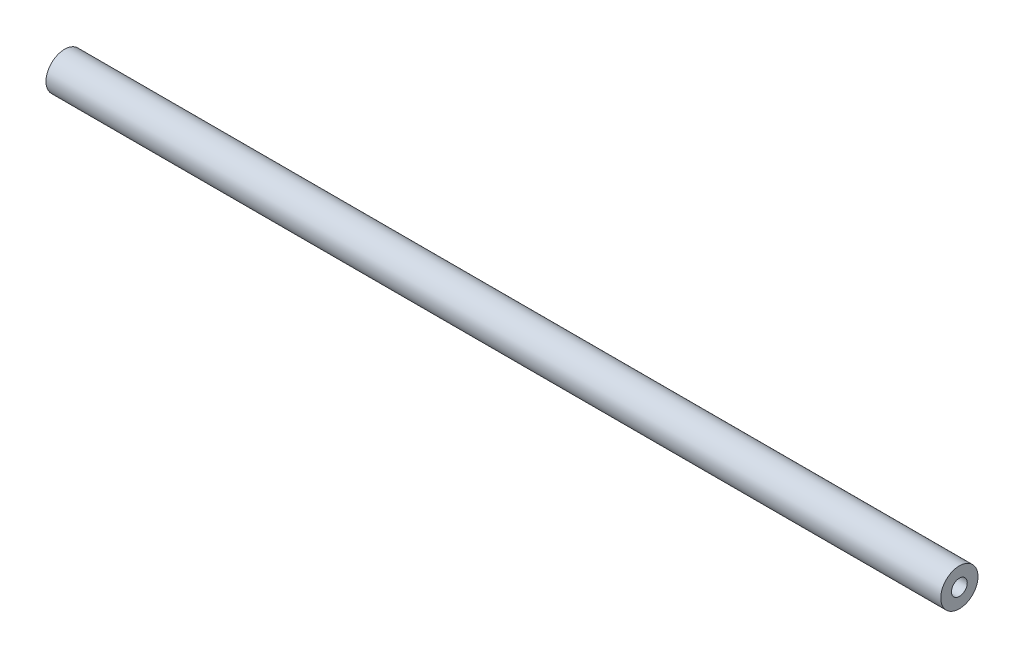
ISO-10303-21;
HEADER;
FILE_DESCRIPTION(('STEP AP214'),'2;1');
FILE_NAME('part.step','',(''),(''),'','','');
FILE_SCHEMA(('AUTOMOTIVE_DESIGN { 1 0 10303 214 1 1 1 1 }'));
ENDSEC;
DATA;
#1=APPLICATION_CONTEXT('core data for automotive mechanical design processes');
#2=APPLICATION_PROTOCOL_DEFINITION('international standard','automotive_design',2000,#1);
#3=PRODUCT_CONTEXT('',#1,'mechanical');
#4=PRODUCT('Part','Part','',(#3));
#5=PRODUCT_RELATED_PRODUCT_CATEGORY('part','',(#4));
#6=PRODUCT_DEFINITION_FORMATION('','',#4);
#7=PRODUCT_DEFINITION_CONTEXT('part definition',#1,'design');
#8=PRODUCT_DEFINITION('design','',#6,#7);
#9=PRODUCT_DEFINITION_SHAPE('','',#8);
#10=(LENGTH_UNIT() NAMED_UNIT(*) SI_UNIT(.MILLI.,.METRE.));
#11=(NAMED_UNIT(*) PLANE_ANGLE_UNIT() SI_UNIT($,.RADIAN.));
#12=(NAMED_UNIT(*) SI_UNIT($,.STERADIAN.) SOLID_ANGLE_UNIT());
#13=UNCERTAINTY_MEASURE_WITH_UNIT(LENGTH_MEASURE(1.E-05),#10,'distance_accuracy_value','');
#14=(GEOMETRIC_REPRESENTATION_CONTEXT(3) GLOBAL_UNCERTAINTY_ASSIGNED_CONTEXT((#13)) GLOBAL_UNIT_ASSIGNED_CONTEXT((#10,
#11,#12)) REPRESENTATION_CONTEXT('',''));
#15=CARTESIAN_POINT('',(0.,0.,0.));
#16=DIRECTION('',(0.,0.,1.));
#17=DIRECTION('',(1.,0.,0.));
#18=AXIS2_PLACEMENT_3D('',#15,#16,#17);
#19=CARTESIAN_POINT('',(114.3,0.,0.));
#20=DIRECTION('',(-1.,0.,0.));
#21=DIRECTION('',(0.,0.,1.));
#22=AXIS2_PLACEMENT_3D('',#19,#20,#21);
#23=CYLINDRICAL_SURFACE('',#22,4.7625);
#24=CARTESIAN_POINT('',(114.3,0.,0.));
#25=DIRECTION('',(1.,0.,0.));
#26=DIRECTION('',(0.,0.,-1.));
#27=AXIS2_PLACEMENT_3D('',#24,#25,#26);
#28=CIRCLE('',#27,4.7625);
#29=CARTESIAN_POINT('',(114.3,0.,-4.7625));
#30=VERTEX_POINT('',#29);
#31=EDGE_CURVE('E10',#30,#30,#28,.T.);
#32=ORIENTED_EDGE('',*,*,#31,.F.);
#33=EDGE_LOOP('',(#32));
#34=FACE_BOUND('',#33,.T.);
#35=CARTESIAN_POINT('',(-114.3,0.,0.));
#36=DIRECTION('',(1.,0.,0.));
#37=DIRECTION('',(0.,0.,-1.));
#38=AXIS2_PLACEMENT_3D('',#35,#36,#37);
#39=CIRCLE('',#38,4.7625);
#40=CARTESIAN_POINT('',(-114.3,0.,-4.7625));
#41=VERTEX_POINT('',#40);
#42=EDGE_CURVE('E38',#41,#41,#39,.T.);
#43=ORIENTED_EDGE('',*,*,#42,.T.);
#44=EDGE_LOOP('',(#43));
#45=FACE_BOUND('',#44,.T.);
#46=ADVANCED_FACE('F35',(#34,#45),#23,.T.);
#47=CARTESIAN_POINT('',(114.3,0.,0.));
#48=DIRECTION('',(1.,0.,0.));
#49=DIRECTION('',(0.,0.,-1.));
#50=AXIS2_PLACEMENT_3D('',#47,#48,#49);
#51=PLANE('',#50);
#52=CARTESIAN_POINT('',(114.3,0.,0.));
#53=DIRECTION('',(1.,0.,0.));
#54=DIRECTION('',(0.,0.,-1.));
#55=AXIS2_PLACEMENT_3D('',#52,#53,#54);
#56=CIRCLE('',#55,2.0193);
#57=CARTESIAN_POINT('',(114.3,0.,-2.0193));
#58=VERTEX_POINT('',#57);
#59=EDGE_CURVE('E55',#58,#58,#56,.T.);
#60=ORIENTED_EDGE('',*,*,#59,.F.);
#61=EDGE_LOOP('',(#60));
#62=FACE_BOUND('',#61,.T.);
#63=ORIENTED_EDGE('',*,*,#31,.T.);
#64=EDGE_LOOP('',(#63));
#65=FACE_BOUND('',#64,.T.);
#66=ADVANCED_FACE('F61',(#62,#65),#51,.T.);
#67=CARTESIAN_POINT('',(-114.3,0.,0.));
#68=DIRECTION('',(1.,0.,0.));
#69=DIRECTION('',(0.,0.,-1.));
#70=AXIS2_PLACEMENT_3D('',#67,#68,#69);
#71=PLANE('',#70);
#72=CARTESIAN_POINT('',(-114.3,0.,0.));
#73=DIRECTION('',(-1.,0.,0.));
#74=DIRECTION('',(0.,0.,1.));
#75=AXIS2_PLACEMENT_3D('',#72,#73,#74);
#76=CIRCLE('',#75,2.0193);
#77=CARTESIAN_POINT('',(-114.3,0.,2.0193));
#78=VERTEX_POINT('',#77);
#79=EDGE_CURVE('E49',#78,#78,#76,.T.);
#80=ORIENTED_EDGE('',*,*,#79,.F.);
#81=EDGE_LOOP('',(#80));
#82=FACE_BOUND('',#81,.T.);
#83=ORIENTED_EDGE('',*,*,#42,.F.);
#84=EDGE_LOOP('',(#83));
#85=FACE_BOUND('',#84,.T.);
#86=ADVANCED_FACE('F63',(#82,#85),#71,.F.);
#87=CARTESIAN_POINT('',(-102.362,0.,0.));
#88=DIRECTION('',(1.,0.,0.));
#89=DIRECTION('',(0.,0.,-1.));
#90=AXIS2_PLACEMENT_3D('',#87,#88,#89);
#91=PLANE('',#90);
#92=CARTESIAN_POINT('',(-102.362,0.,0.));
#93=DIRECTION('',(-1.,0.,0.));
#94=DIRECTION('',(0.,0.,1.));
#95=AXIS2_PLACEMENT_3D('',#92,#93,#94);
#96=CIRCLE('',#95,2.0193);
#97=CARTESIAN_POINT('',(-102.362,0.,2.0193));
#98=VERTEX_POINT('',#97);
#99=EDGE_CURVE('E45',#98,#98,#96,.T.);
#100=ORIENTED_EDGE('',*,*,#99,.T.);
#101=EDGE_LOOP('',(#100));
#102=FACE_BOUND('',#101,.T.);
#103=ADVANCED_FACE('F69',(#102),#91,.F.);
#104=CARTESIAN_POINT('',(-114.3,0.,0.));
#105=DIRECTION('',(-1.,0.,0.));
#106=DIRECTION('',(0.,0.,1.));
#107=AXIS2_PLACEMENT_3D('',#104,#105,#106);
#108=CYLINDRICAL_SURFACE('',#107,2.0193);
#109=ORIENTED_EDGE('',*,*,#99,.F.);
#110=EDGE_LOOP('',(#109));
#111=FACE_BOUND('',#110,.T.);
#112=ORIENTED_EDGE('',*,*,#79,.T.);
#113=EDGE_LOOP('',(#112));
#114=FACE_BOUND('',#113,.T.);
#115=ADVANCED_FACE('F75',(#111,#114),#108,.F.);
#116=CARTESIAN_POINT('',(102.362,0.,0.));
#117=DIRECTION('',(-1.,0.,0.));
#118=DIRECTION('',(0.,0.,1.));
#119=AXIS2_PLACEMENT_3D('',#116,#117,#118);
#120=PLANE('',#119);
#121=CARTESIAN_POINT('',(102.362,0.,0.));
#122=DIRECTION('',(1.,0.,0.));
#123=DIRECTION('',(0.,0.,-1.));
#124=AXIS2_PLACEMENT_3D('',#121,#122,#123);
#125=CIRCLE('',#124,2.0193);
#126=CARTESIAN_POINT('',(102.362,0.,-2.0193));
#127=VERTEX_POINT('',#126);
#128=EDGE_CURVE('E52',#127,#127,#125,.T.);
#129=ORIENTED_EDGE('',*,*,#128,.T.);
#130=EDGE_LOOP('',(#129));
#131=FACE_BOUND('',#130,.T.);
#132=ADVANCED_FACE('F79',(#131),#120,.F.);
#133=CARTESIAN_POINT('',(114.3,0.,0.));
#134=DIRECTION('',(1.,0.,0.));
#135=DIRECTION('',(0.,0.,-1.));
#136=AXIS2_PLACEMENT_3D('',#133,#134,#135);
#137=CYLINDRICAL_SURFACE('',#136,2.0193);
#138=ORIENTED_EDGE('',*,*,#128,.F.);
#139=EDGE_LOOP('',(#138));
#140=FACE_BOUND('',#139,.T.);
#141=ORIENTED_EDGE('',*,*,#59,.T.);
#142=EDGE_LOOP('',(#141));
#143=FACE_BOUND('',#142,.T.);
#144=ADVANCED_FACE('F59',(#140,#143),#137,.F.);
#145=CLOSED_SHELL('',(#46,#66,#86,#103,#115,#132,#144));
#146=MANIFOLD_SOLID_BREP('B2',#145);
#147=ADVANCED_BREP_SHAPE_REPRESENTATION('',(#18,#146),#14);
#148=SHAPE_DEFINITION_REPRESENTATION(#9,#147);
ENDSEC;
END-ISO-10303-21;
